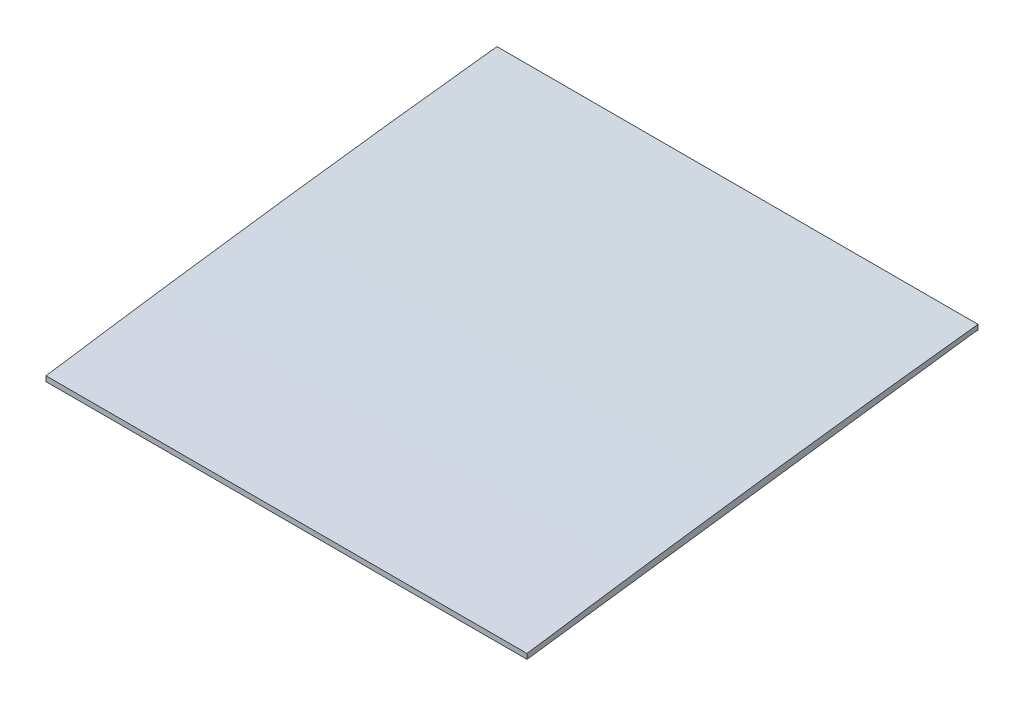
ISO-10303-21;
HEADER;
FILE_DESCRIPTION(('STEP AP214'),'2;1');
FILE_NAME('part.step','',(''),(''),'','','');
FILE_SCHEMA(('AUTOMOTIVE_DESIGN { 1 0 10303 214 1 1 1 1 }'));
ENDSEC;
DATA;
#1=APPLICATION_CONTEXT('core data for automotive mechanical design processes');
#2=APPLICATION_PROTOCOL_DEFINITION('international standard','automotive_design',2000,#1);
#3=PRODUCT_CONTEXT('',#1,'mechanical');
#4=PRODUCT('Part','Part','',(#3));
#5=PRODUCT_RELATED_PRODUCT_CATEGORY('part','',(#4));
#6=PRODUCT_DEFINITION_FORMATION('','',#4);
#7=PRODUCT_DEFINITION_CONTEXT('part definition',#1,'design');
#8=PRODUCT_DEFINITION('design','',#6,#7);
#9=PRODUCT_DEFINITION_SHAPE('','',#8);
#10=(LENGTH_UNIT() NAMED_UNIT(*) SI_UNIT(.MILLI.,.METRE.));
#11=(NAMED_UNIT(*) PLANE_ANGLE_UNIT() SI_UNIT($,.RADIAN.));
#12=(NAMED_UNIT(*) SI_UNIT($,.STERADIAN.) SOLID_ANGLE_UNIT());
#13=UNCERTAINTY_MEASURE_WITH_UNIT(LENGTH_MEASURE(1.E-05),#10,'distance_accuracy_value','');
#14=(GEOMETRIC_REPRESENTATION_CONTEXT(3) GLOBAL_UNCERTAINTY_ASSIGNED_CONTEXT((#13)) GLOBAL_UNIT_ASSIGNED_CONTEXT((#10,
#11,#12)) REPRESENTATION_CONTEXT('',''));
#15=CARTESIAN_POINT('',(0.,0.,0.));
#16=DIRECTION('',(0.,0.,1.));
#17=DIRECTION('',(1.,0.,0.));
#18=AXIS2_PLACEMENT_3D('',#15,#16,#17);
#19=CARTESIAN_POINT('',(426.330459101307,18.1010739301015,394.61134670018));
#20=CARTESIAN_POINT('',(426.330459101307,17.313789287683,401.599777122411));
#21=CARTESIAN_POINT('',(426.330459101307,15.4666237851036,416.618786987929));
#22=CARTESIAN_POINT('',(426.330459101307,13.3567845765839,431.602522039951));
#23=CARTESIAN_POINT('',(426.330459101307,12.1551018219456,439.611346700191));
#24=B_SPLINE_CURVE_WITH_KNOTS('',3,(#19,#20,#21,#22,#23),.UNSPECIFIED.,.F.,.F.,(4,1,4),
(0.81631029544429,0.850793680090034,0.890503407189251),.UNSPECIFIED.);
#25=DIRECTION('',(-1.,0.,0.));
#26=VECTOR('',#25,1.);
#27=SURFACE_OF_LINEAR_EXTRUSION('',#24,#26);
#28=CARTESIAN_POINT('',(378.330459101307,18.1010739301015,394.61134670018));
#29=CARTESIAN_POINT('',(378.330459101307,17.313789287683,401.599777122411));
#30=CARTESIAN_POINT('',(378.330459101307,15.4666237851036,416.618786987929));
#31=CARTESIAN_POINT('',(378.330459101307,13.3567845765839,431.602522039951));
#32=CARTESIAN_POINT('',(378.330459101307,12.1551018219456,439.611346700191));
#33=B_SPLINE_CURVE_WITH_KNOTS('',3,(#28,#29,#30,#31,#32),.UNSPECIFIED.,.F.,.F.,(4,1,4),
(0.81631029544429,0.850793680090034,0.890503407189251),.UNSPECIFIED.);
#34=CARTESIAN_POINT('',(378.330459101307,18.1010739302022,394.611346700191));
#35=VERTEX_POINT('',#34);
#36=CARTESIAN_POINT('',(378.330459101307,12.1551018219456,439.611346700191));
#37=VERTEX_POINT('',#36);
#38=EDGE_CURVE('E117',#35,#37,#33,.T.);
#39=ORIENTED_EDGE('',*,*,#38,.T.);
#40=DIRECTION('',(-1.,0.,0.));
#41=VECTOR('',#40,1.);
#42=CARTESIAN_POINT('',(426.330459101307,12.1551018219456,439.611346700191));
#43=LINE('',#42,#41);
#44=CARTESIAN_POINT('',(426.330459101307,12.1551018219456,439.611346700191));
#45=VERTEX_POINT('',#44);
#46=EDGE_CURVE('E11',#45,#37,#43,.T.);
#47=ORIENTED_EDGE('',*,*,#46,.F.);
#48=CARTESIAN_POINT('',(426.330459101307,18.1010739302022,394.611346700191));
#49=VERTEX_POINT('',#48);
#50=EDGE_CURVE('E130',#49,#45,#24,.T.);
#51=ORIENTED_EDGE('',*,*,#50,.F.);
#52=DIRECTION('',(-1.,0.,0.));
#53=VECTOR('',#52,1.);
#54=CARTESIAN_POINT('',(426.330459101307,18.1010739302022,394.611346700191));
#55=LINE('',#54,#53);
#56=EDGE_CURVE('E113',#49,#35,#55,.T.);
#57=ORIENTED_EDGE('',*,*,#56,.T.);
#58=EDGE_LOOP('',(#39,#47,#51,#57));
#59=FACE_BOUND('',#58,.T.);
#60=ADVANCED_FACE('F42',(#59),#27,.F.);
#61=CARTESIAN_POINT('',(426.330459101307,12.1551018219456,439.611346700191));
#62=DIRECTION('',(0.,0.,-1.));
#63=DIRECTION('',(-1.,0.,0.));
#64=AXIS2_PLACEMENT_3D('',#61,#62,#63);
#65=PLANE('',#64);
#66=DIRECTION('',(0.,-1.,0.));
#67=VECTOR('',#66,1.);
#68=CARTESIAN_POINT('',(378.330459101307,12.1551018219456,439.611346700191));
#69=LINE('',#68,#67);
#70=CARTESIAN_POINT('',(378.330459101307,11.6461411368967,439.611346700191));
#71=VERTEX_POINT('',#70);
#72=EDGE_CURVE('E122',#37,#71,#69,.T.);
#73=ORIENTED_EDGE('',*,*,#72,.T.);
#74=DIRECTION('',(-1.,0.,0.));
#75=VECTOR('',#74,1.);
#76=CARTESIAN_POINT('',(426.330459101307,11.6461411368967,439.611346700191));
#77=LINE('',#76,#75);
#78=CARTESIAN_POINT('',(426.330459101307,11.6461411368967,439.611346700191));
#79=VERTEX_POINT('',#78);
#80=EDGE_CURVE('E51',#79,#71,#77,.T.);
#81=ORIENTED_EDGE('',*,*,#80,.F.);
#82=DIRECTION('',(0.,-1.,0.));
#83=VECTOR('',#82,1.);
#84=CARTESIAN_POINT('',(426.330459101307,12.1551018219456,439.611346700191));
#85=LINE('',#84,#83);
#86=EDGE_CURVE('E93',#45,#79,#85,.T.);
#87=ORIENTED_EDGE('',*,*,#86,.F.);
#88=ORIENTED_EDGE('',*,*,#46,.T.);
#89=EDGE_LOOP('',(#73,#81,#87,#88));
#90=FACE_BOUND('',#89,.T.);
#91=ADVANCED_FACE('F150',(#90),#65,.F.);
#92=CARTESIAN_POINT('',(426.330459101307,17.5960094864389,394.911346700191));
#93=DIRECTION('',(0.,0.991257309800528,0.131942964067887));
#94=DIRECTION('',(0.,-0.131942964067887,0.991257309800528));
#95=AXIS2_PLACEMENT_3D('',#92,#93,#94);
#96=PLANE('',#95);
#97=DIRECTION('',(0.,0.131942964067887,-0.991257309800528));
#98=VECTOR('',#97,1.);
#99=CARTESIAN_POINT('',(378.330459101307,17.5960094864389,394.911346700191));
#100=LINE('',#99,#98);
#101=CARTESIAN_POINT('',(378.330459101307,17.5960094864389,394.911346700191));
#102=VERTEX_POINT('',#101);
#103=EDGE_CURVE('E108',#71,#102,#100,.T.);
#104=ORIENTED_EDGE('',*,*,#103,.T.);
#105=DIRECTION('',(-1.,0.,0.));
#106=VECTOR('',#105,1.);
#107=CARTESIAN_POINT('',(426.330459101307,17.5960094864389,394.911346700191));
#108=LINE('',#107,#106);
#109=CARTESIAN_POINT('',(426.330459101307,17.5960094864389,394.911346700191));
#110=VERTEX_POINT('',#109);
#111=EDGE_CURVE('E105',#110,#102,#108,.T.);
#112=ORIENTED_EDGE('',*,*,#111,.F.);
#113=DIRECTION('',(0.,0.131942964067887,-0.991257309800528));
#114=VECTOR('',#113,1.);
#115=CARTESIAN_POINT('',(426.330459101307,17.5960094864389,394.911346700191));
#116=LINE('',#115,#114);
#117=EDGE_CURVE('E97',#79,#110,#116,.T.);
#118=ORIENTED_EDGE('',*,*,#117,.F.);
#119=ORIENTED_EDGE('',*,*,#80,.T.);
#120=EDGE_LOOP('',(#104,#112,#118,#119));
#121=FACE_BOUND('',#120,.T.);
#122=ADVANCED_FACE('F106',(#121),#96,.F.);
#123=CARTESIAN_POINT('',(426.330459101307,17.5960094864389,394.911346700191));
#124=DIRECTION('',(0.,1.,0.));
#125=DIRECTION('',(0.,0.,1.));
#126=AXIS2_PLACEMENT_3D('',#123,#124,#125);
#127=PLANE('',#126);
#128=DIRECTION('',(0.,0.,-1.));
#129=VECTOR('',#128,1.);
#130=CARTESIAN_POINT('',(378.330459101307,17.5960094864389,394.911346700191));
#131=LINE('',#130,#129);
#132=CARTESIAN_POINT('',(378.330459101307,17.5960094864389,394.611346700191));
#133=VERTEX_POINT('',#132);
#134=EDGE_CURVE('E79',#102,#133,#131,.T.);
#135=ORIENTED_EDGE('',*,*,#134,.T.);
#136=DIRECTION('',(-1.,0.,0.));
#137=VECTOR('',#136,1.);
#138=CARTESIAN_POINT('',(426.330459101307,17.5960094864389,394.611346700191));
#139=LINE('',#138,#137);
#140=CARTESIAN_POINT('',(426.330459101307,17.5960094864389,394.611346700191));
#141=VERTEX_POINT('',#140);
#142=EDGE_CURVE('E109',#141,#133,#139,.T.);
#143=ORIENTED_EDGE('',*,*,#142,.F.);
#144=DIRECTION('',(0.,0.,-1.));
#145=VECTOR('',#144,1.);
#146=CARTESIAN_POINT('',(426.330459101307,17.5960094864389,394.911346700191));
#147=LINE('',#146,#145);
#148=EDGE_CURVE('E101',#110,#141,#147,.T.);
#149=ORIENTED_EDGE('',*,*,#148,.F.);
#150=ORIENTED_EDGE('',*,*,#111,.T.);
#151=EDGE_LOOP('',(#135,#143,#149,#150));
#152=FACE_BOUND('',#151,.T.);
#153=ADVANCED_FACE('F111',(#152),#127,.F.);
#154=CARTESIAN_POINT('',(426.330459101307,18.1010739302022,394.611346700191));
#155=DIRECTION('',(0.,0.,1.));
#156=DIRECTION('',(1.,0.,0.));
#157=AXIS2_PLACEMENT_3D('',#154,#155,#156);
#158=PLANE('',#157);
#159=DIRECTION('',(0.,1.,0.));
#160=VECTOR('',#159,1.);
#161=CARTESIAN_POINT('',(378.330459101307,18.1010739302022,394.611346700191));
#162=LINE('',#161,#160);
#163=EDGE_CURVE('E85',#133,#35,#162,.T.);
#164=ORIENTED_EDGE('',*,*,#163,.T.);
#165=ORIENTED_EDGE('',*,*,#56,.F.);
#166=DIRECTION('',(0.,1.,0.));
#167=VECTOR('',#166,1.);
#168=CARTESIAN_POINT('',(426.330459101307,18.1010739302022,394.611346700191));
#169=LINE('',#168,#167);
#170=EDGE_CURVE('E59',#141,#49,#169,.T.);
#171=ORIENTED_EDGE('',*,*,#170,.F.);
#172=ORIENTED_EDGE('',*,*,#142,.T.);
#173=EDGE_LOOP('',(#164,#165,#171,#172));
#174=FACE_BOUND('',#173,.T.);
#175=ADVANCED_FACE('F138',(#174),#158,.F.);
#176=CARTESIAN_POINT('',(426.330459101307,15.3309450507614,417.13829083151));
#177=DIRECTION('',(-1.,0.,0.));
#178=DIRECTION('',(0.,0.,1.));
#179=AXIS2_PLACEMENT_3D('',#176,#177,#178);
#180=PLANE('',#179);
#181=ORIENTED_EDGE('',*,*,#50,.T.);
#182=ORIENTED_EDGE('',*,*,#86,.T.);
#183=ORIENTED_EDGE('',*,*,#117,.T.);
#184=ORIENTED_EDGE('',*,*,#148,.T.);
#185=ORIENTED_EDGE('',*,*,#170,.T.);
#186=EDGE_LOOP('',(#181,#182,#183,#184,#185));
#187=FACE_BOUND('',#186,.T.);
#188=ADVANCED_FACE('F99',(#187),#180,.F.);
#189=CARTESIAN_POINT('',(378.330459101307,15.3309450507614,417.13829083151));
#190=DIRECTION('',(-1.,0.,0.));
#191=DIRECTION('',(0.,0.,1.));
#192=AXIS2_PLACEMENT_3D('',#189,#190,#191);
#193=PLANE('',#192);
#194=ORIENTED_EDGE('',*,*,#38,.F.);
#195=ORIENTED_EDGE('',*,*,#163,.F.);
#196=ORIENTED_EDGE('',*,*,#134,.F.);
#197=ORIENTED_EDGE('',*,*,#103,.F.);
#198=ORIENTED_EDGE('',*,*,#72,.F.);
#199=EDGE_LOOP('',(#194,#195,#196,#197,#198));
#200=FACE_BOUND('',#199,.T.);
#201=ADVANCED_FACE('F134',(#200),#193,.T.);
#202=CLOSED_SHELL('',(#60,#91,#122,#153,#175,#188,#201));
#203=MANIFOLD_SOLID_BREP('B2',#202);
#204=ADVANCED_BREP_SHAPE_REPRESENTATION('',(#18,#203),#14);
#205=SHAPE_DEFINITION_REPRESENTATION(#9,#204);
ENDSEC;
END-ISO-10303-21;
